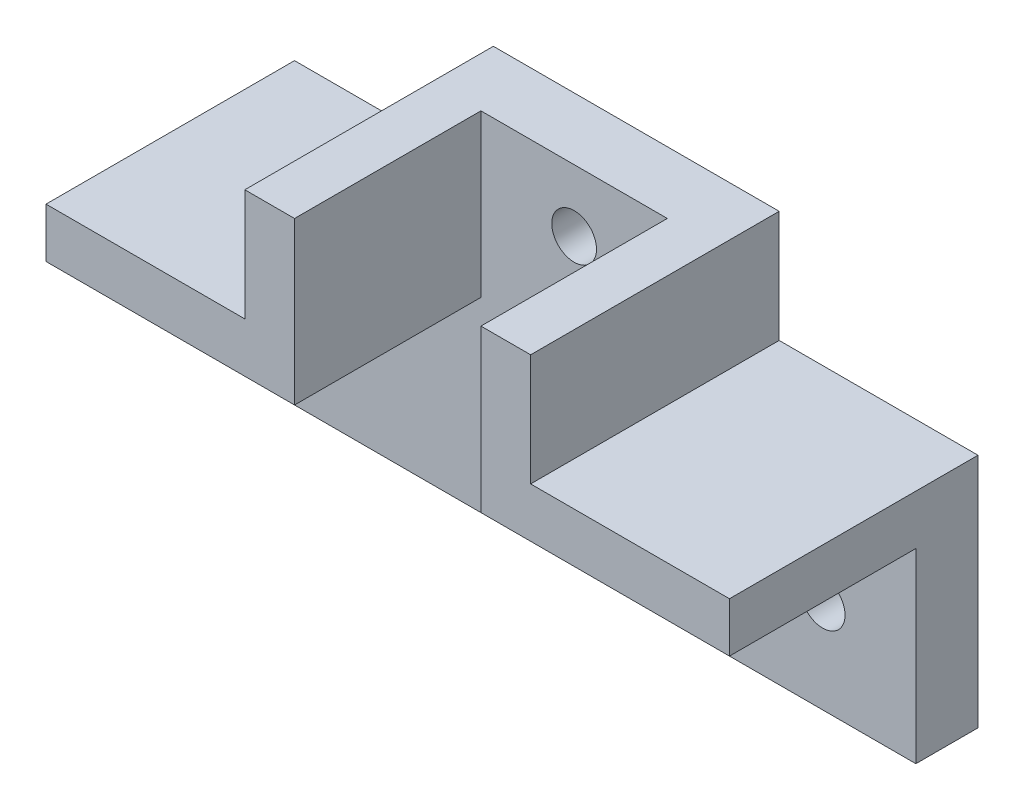
ISO-10303-21;
HEADER;
FILE_DESCRIPTION(('STEP AP214'),'2;1');
FILE_NAME('part.step','',(''),(''),'','','');
FILE_SCHEMA(('AUTOMOTIVE_DESIGN { 1 0 10303 214 1 1 1 1 }'));
ENDSEC;
DATA;
#1=APPLICATION_CONTEXT('core data for automotive mechanical design processes');
#2=APPLICATION_PROTOCOL_DEFINITION('international standard','automotive_design',2000,#1);
#3=PRODUCT_CONTEXT('',#1,'mechanical');
#4=PRODUCT('Part','Part','',(#3));
#5=PRODUCT_RELATED_PRODUCT_CATEGORY('part','',(#4));
#6=PRODUCT_DEFINITION_FORMATION('','',#4);
#7=PRODUCT_DEFINITION_CONTEXT('part definition',#1,'design');
#8=PRODUCT_DEFINITION('design','',#6,#7);
#9=PRODUCT_DEFINITION_SHAPE('','',#8);
#10=(LENGTH_UNIT() NAMED_UNIT(*) SI_UNIT(.MILLI.,.METRE.));
#11=(NAMED_UNIT(*) PLANE_ANGLE_UNIT() SI_UNIT($,.RADIAN.));
#12=(NAMED_UNIT(*) SI_UNIT($,.STERADIAN.) SOLID_ANGLE_UNIT());
#13=UNCERTAINTY_MEASURE_WITH_UNIT(LENGTH_MEASURE(1.E-05),#10,'distance_accuracy_value','');
#14=(GEOMETRIC_REPRESENTATION_CONTEXT(3) GLOBAL_UNCERTAINTY_ASSIGNED_CONTEXT((#13)) GLOBAL_UNIT_ASSIGNED_CONTEXT((#10,
#11,#12)) REPRESENTATION_CONTEXT('',''));
#15=CARTESIAN_POINT('',(0.,0.,0.));
#16=DIRECTION('',(0.,0.,1.));
#17=DIRECTION('',(1.,0.,0.));
#18=AXIS2_PLACEMENT_3D('',#15,#16,#17);
#19=CARTESIAN_POINT('',(-20.6862745098039,2.73529411764706,5.));
#20=DIRECTION('',(1.,0.,0.));
#21=DIRECTION('',(0.,1.,0.));
#22=AXIS2_PLACEMENT_3D('',#19,#20,#21);
#23=PLANE('',#22);
#24=DIRECTION('',(0.,-1.,0.));
#25=VECTOR('',#24,1.);
#26=CARTESIAN_POINT('',(-20.6862745098039,2.73529411764706,0.));
#27=LINE('',#26,#25);
#28=CARTESIAN_POINT('',(-20.6862745098039,6.73529411764706,0.));
#29=VERTEX_POINT('',#28);
#30=CARTESIAN_POINT('',(-20.6862745098039,-12.2647058823529,0.));
#31=VERTEX_POINT('',#30);
#32=EDGE_CURVE('E171',#29,#31,#27,.T.);
#33=ORIENTED_EDGE('',*,*,#32,.T.);
#34=DIRECTION('',(0.,0.,-1.));
#35=VECTOR('',#34,1.);
#36=CARTESIAN_POINT('',(-20.6862745098039,-12.2647058823529,5.));
#37=LINE('',#36,#35);
#38=CARTESIAN_POINT('',(-20.6862745098039,-12.2647058823529,5.));
#39=VERTEX_POINT('',#38);
#40=EDGE_CURVE('E11',#39,#31,#37,.T.);
#41=ORIENTED_EDGE('',*,*,#40,.F.);
#42=DIRECTION('',(0.,-1.,0.));
#43=VECTOR('',#42,1.);
#44=CARTESIAN_POINT('',(-20.6862745098039,2.73529411764706,5.));
#45=LINE('',#44,#43);
#46=CARTESIAN_POINT('',(-20.6862745098039,2.73529411764706,5.));
#47=VERTEX_POINT('',#46);
#48=EDGE_CURVE('E154',#47,#39,#45,.T.);
#49=ORIENTED_EDGE('',*,*,#48,.F.);
#50=DIRECTION('',(0.,0.,-1.));
#51=VECTOR('',#50,1.);
#52=CARTESIAN_POINT('',(-20.6862745098039,2.73529411764706,20.));
#53=LINE('',#52,#51);
#54=CARTESIAN_POINT('',(-20.6862745098039,2.73529411764706,20.));
#55=VERTEX_POINT('',#54);
#56=EDGE_CURVE('E76',#55,#47,#53,.T.);
#57=ORIENTED_EDGE('',*,*,#56,.F.);
#58=DIRECTION('',(0.,1.,0.));
#59=VECTOR('',#58,1.);
#60=CARTESIAN_POINT('',(-20.6862745098039,2.73529411764706,20.));
#61=LINE('',#60,#59);
#62=CARTESIAN_POINT('',(-20.6862745098039,6.73529411764706,20.));
#63=VERTEX_POINT('',#62);
#64=EDGE_CURVE('E243',#55,#63,#61,.T.);
#65=ORIENTED_EDGE('',*,*,#64,.T.);
#66=DIRECTION('',(0.,0.,-1.));
#67=VECTOR('',#66,1.);
#68=CARTESIAN_POINT('',(-20.6862745098039,6.73529411764706,20.));
#69=LINE('',#68,#67);
#70=EDGE_CURVE('E149',#63,#29,#69,.T.);
#71=ORIENTED_EDGE('',*,*,#70,.T.);
#72=EDGE_LOOP('',(#33,#41,#49,#57,#65,#71));
#73=FACE_BOUND('',#72,.T.);
#74=ADVANCED_FACE('F39',(#73),#23,.F.);
#75=CARTESIAN_POINT('',(-20.6862745098039,-12.2647058823529,5.));
#76=DIRECTION('',(0.,1.,0.));
#77=DIRECTION('',(0.,0.,1.));
#78=AXIS2_PLACEMENT_3D('',#75,#76,#77);
#79=PLANE('',#78);
#80=DIRECTION('',(1.,0.,0.));
#81=VECTOR('',#80,1.);
#82=CARTESIAN_POINT('',(-20.6862745098039,-12.2647058823529,0.));
#83=LINE('',#82,#81);
#84=CARTESIAN_POINT('',(34.3137254901961,-12.2647058823529,0.));
#85=VERTEX_POINT('',#84);
#86=EDGE_CURVE('E68',#31,#85,#83,.T.);
#87=ORIENTED_EDGE('',*,*,#86,.T.);
#88=DIRECTION('',(0.,0.,-1.));
#89=VECTOR('',#88,1.);
#90=CARTESIAN_POINT('',(34.3137254901961,-12.2647058823529,5.));
#91=LINE('',#90,#89);
#92=CARTESIAN_POINT('',(34.3137254901961,-12.2647058823529,5.));
#93=VERTEX_POINT('',#92);
#94=EDGE_CURVE('E48',#93,#85,#91,.T.);
#95=ORIENTED_EDGE('',*,*,#94,.F.);
#96=DIRECTION('',(1.,0.,0.));
#97=VECTOR('',#96,1.);
#98=CARTESIAN_POINT('',(-20.6862745098039,-12.2647058823529,5.));
#99=LINE('',#98,#97);
#100=EDGE_CURVE('E157',#39,#93,#99,.T.);
#101=ORIENTED_EDGE('',*,*,#100,.F.);
#102=ORIENTED_EDGE('',*,*,#40,.T.);
#103=EDGE_LOOP('',(#87,#95,#101,#102));
#104=FACE_BOUND('',#103,.T.);
#105=ADVANCED_FACE('F286',(#104),#79,.F.);
#106=CARTESIAN_POINT('',(34.3137254901961,2.73529411764706,5.));
#107=DIRECTION('',(-1.,0.,0.));
#108=DIRECTION('',(0.,0.,1.));
#109=AXIS2_PLACEMENT_3D('',#106,#107,#108);
#110=PLANE('',#109);
#111=DIRECTION('',(0.,1.,0.));
#112=VECTOR('',#111,1.);
#113=CARTESIAN_POINT('',(34.3137254901961,2.73529411764706,0.));
#114=LINE('',#113,#112);
#115=CARTESIAN_POINT('',(34.3137254901961,6.73529411764706,0.));
#116=VERTEX_POINT('',#115);
#117=EDGE_CURVE('E177',#85,#116,#114,.T.);
#118=ORIENTED_EDGE('',*,*,#117,.T.);
#119=DIRECTION('',(0.,0.,-1.));
#120=VECTOR('',#119,1.);
#121=CARTESIAN_POINT('',(34.3137254901961,6.73529411764706,20.));
#122=LINE('',#121,#120);
#123=CARTESIAN_POINT('',(34.3137254901961,6.73529411764706,20.));
#124=VERTEX_POINT('',#123);
#125=EDGE_CURVE('E211',#124,#116,#122,.T.);
#126=ORIENTED_EDGE('',*,*,#125,.F.);
#127=DIRECTION('',(0.,1.,0.));
#128=VECTOR('',#127,1.);
#129=CARTESIAN_POINT('',(34.3137254901961,2.73529411764705,20.));
#130=LINE('',#129,#128);
#131=CARTESIAN_POINT('',(34.3137254901961,2.73529411764705,20.));
#132=VERTEX_POINT('',#131);
#133=EDGE_CURVE('E208',#132,#124,#130,.T.);
#134=ORIENTED_EDGE('',*,*,#133,.F.);
#135=DIRECTION('',(0.,0.,-1.));
#136=VECTOR('',#135,1.);
#137=CARTESIAN_POINT('',(34.3137254901961,2.73529411764705,20.));
#138=LINE('',#137,#136);
#139=CARTESIAN_POINT('',(34.3137254901961,2.73529411764706,5.));
#140=VERTEX_POINT('',#139);
#141=EDGE_CURVE('E240',#132,#140,#138,.T.);
#142=ORIENTED_EDGE('',*,*,#141,.T.);
#143=DIRECTION('',(0.,1.,0.));
#144=VECTOR('',#143,1.);
#145=CARTESIAN_POINT('',(34.3137254901961,2.73529411764706,5.));
#146=LINE('',#145,#144);
#147=EDGE_CURVE('E161',#93,#140,#146,.T.);
#148=ORIENTED_EDGE('',*,*,#147,.F.);
#149=ORIENTED_EDGE('',*,*,#94,.T.);
#150=EDGE_LOOP('',(#118,#126,#134,#142,#148,#149));
#151=FACE_BOUND('',#150,.T.);
#152=ADVANCED_FACE('F187',(#151),#110,.F.);
#153=CARTESIAN_POINT('',(-0.686274509803913,15.7352941176471,5.));
#154=DIRECTION('',(0.,-1.,0.));
#155=DIRECTION('',(0.,0.,-1.));
#156=AXIS2_PLACEMENT_3D('',#153,#154,#155);
#157=PLANE('',#156);
#158=DIRECTION('',(-1.,0.,0.));
#159=VECTOR('',#158,1.);
#160=CARTESIAN_POINT('',(-0.686274509803913,15.7352941176471,0.));
#161=LINE('',#160,#159);
#162=CARTESIAN_POINT('',(18.3137254901961,15.7352941176471,0.));
#163=VERTEX_POINT('',#162);
#164=CARTESIAN_POINT('',(-4.68627450980391,15.7352941176471,0.));
#165=VERTEX_POINT('',#164);
#166=EDGE_CURVE('E158',#163,#165,#161,.T.);
#167=ORIENTED_EDGE('',*,*,#166,.T.);
#168=DIRECTION('',(0.,0.,-1.));
#169=VECTOR('',#168,1.);
#170=CARTESIAN_POINT('',(-4.68627450980391,15.7352941176471,20.));
#171=LINE('',#170,#169);
#172=CARTESIAN_POINT('',(-4.68627450980391,15.7352941176471,20.));
#173=VERTEX_POINT('',#172);
#174=EDGE_CURVE('E137',#173,#165,#171,.T.);
#175=ORIENTED_EDGE('',*,*,#174,.F.);
#176=DIRECTION('',(-1.,0.,0.));
#177=VECTOR('',#176,1.);
#178=CARTESIAN_POINT('',(-0.686274509803913,15.7352941176471,20.));
#179=LINE('',#178,#177);
#180=CARTESIAN_POINT('',(-0.686274509803913,15.7352941176471,20.));
#181=VERTEX_POINT('',#180);
#182=EDGE_CURVE('E134',#181,#173,#179,.T.);
#183=ORIENTED_EDGE('',*,*,#182,.F.);
#184=DIRECTION('',(0.,0.,-1.));
#185=VECTOR('',#184,1.);
#186=CARTESIAN_POINT('',(-0.686274509803913,15.7352941176471,20.));
#187=LINE('',#186,#185);
#188=CARTESIAN_POINT('',(-0.686274509803913,15.7352941176471,5.));
#189=VERTEX_POINT('',#188);
#190=EDGE_CURVE('E125',#181,#189,#187,.T.);
#191=ORIENTED_EDGE('',*,*,#190,.T.);
#192=DIRECTION('',(-1.,0.,0.));
#193=VECTOR('',#192,1.);
#194=CARTESIAN_POINT('',(-0.686274509803913,15.7352941176471,5.));
#195=LINE('',#194,#193);
#196=CARTESIAN_POINT('',(14.3137254901961,15.7352941176471,5.));
#197=VERTEX_POINT('',#196);
#198=EDGE_CURVE('E108',#197,#189,#195,.T.);
#199=ORIENTED_EDGE('',*,*,#198,.F.);
#200=DIRECTION('',(0.,0.,-1.));
#201=VECTOR('',#200,1.);
#202=CARTESIAN_POINT('',(14.3137254901961,15.7352941176471,20.));
#203=LINE('',#202,#201);
#204=CARTESIAN_POINT('',(14.3137254901961,15.7352941176471,20.));
#205=VERTEX_POINT('',#204);
#206=EDGE_CURVE('E233',#205,#197,#203,.T.);
#207=ORIENTED_EDGE('',*,*,#206,.F.);
#208=DIRECTION('',(1.,0.,0.));
#209=VECTOR('',#208,1.);
#210=CARTESIAN_POINT('',(14.3137254901961,15.7352941176471,20.));
#211=LINE('',#210,#209);
#212=CARTESIAN_POINT('',(18.3137254901961,15.7352941176471,20.));
#213=VERTEX_POINT('',#212);
#214=EDGE_CURVE('E308',#205,#213,#211,.T.);
#215=ORIENTED_EDGE('',*,*,#214,.T.);
#216=DIRECTION('',(0.,0.,-1.));
#217=VECTOR('',#216,1.);
#218=CARTESIAN_POINT('',(18.3137254901961,15.7352941176471,20.));
#219=LINE('',#218,#217);
#220=EDGE_CURVE('E226',#213,#163,#219,.T.);
#221=ORIENTED_EDGE('',*,*,#220,.T.);
#222=EDGE_LOOP('',(#167,#175,#183,#191,#199,#207,#215,#221));
#223=FACE_BOUND('',#222,.T.);
#224=ADVANCED_FACE('F131',(#223),#157,.F.);
#225=CARTESIAN_POINT('',(0.,0.,5.));
#226=DIRECTION('',(0.,0.,1.));
#227=DIRECTION('',(1.,0.,0.));
#228=AXIS2_PLACEMENT_3D('',#225,#226,#227);
#229=PLANE('',#228);
#230=CARTESIAN_POINT('',(6.81372549019609,10.7352941176471,5.));
#231=DIRECTION('',(0.,0.,1.));
#232=DIRECTION('',(1.,0.,0.));
#233=AXIS2_PLACEMENT_3D('',#230,#231,#232);
#234=CIRCLE('',#233,1.8);
#235=CARTESIAN_POINT('',(8.61372549019609,10.7352941176471,5.));
#236=VERTEX_POINT('',#235);
#237=EDGE_CURVE('E324',#236,#236,#234,.T.);
#238=ORIENTED_EDGE('',*,*,#237,.F.);
#239=EDGE_LOOP('',(#238));
#240=FACE_BOUND('',#239,.T.);
#241=CARTESIAN_POINT('',(-13.1862745098039,-4.76470588235294,5.));
#242=DIRECTION('',(0.,0.,1.));
#243=DIRECTION('',(1.,0.,0.));
#244=AXIS2_PLACEMENT_3D('',#241,#242,#243);
#245=CIRCLE('',#244,1.8);
#246=CARTESIAN_POINT('',(-11.3862745098039,-4.76470588235294,5.));
#247=VERTEX_POINT('',#246);
#248=EDGE_CURVE('E336',#247,#247,#245,.T.);
#249=ORIENTED_EDGE('',*,*,#248,.F.);
#250=EDGE_LOOP('',(#249));
#251=FACE_BOUND('',#250,.T.);
#252=CARTESIAN_POINT('',(26.8137254901961,-4.76470588235294,5.));
#253=DIRECTION('',(0.,0.,1.));
#254=DIRECTION('',(1.,0.,0.));
#255=AXIS2_PLACEMENT_3D('',#252,#253,#254);
#256=CIRCLE('',#255,1.8);
#257=CARTESIAN_POINT('',(28.6137254901961,-4.76470588235294,5.));
#258=VERTEX_POINT('',#257);
#259=EDGE_CURVE('E343',#258,#258,#256,.T.);
#260=ORIENTED_EDGE('',*,*,#259,.F.);
#261=EDGE_LOOP('',(#260));
#262=FACE_BOUND('',#261,.T.);
#263=ORIENTED_EDGE('',*,*,#48,.T.);
#264=ORIENTED_EDGE('',*,*,#100,.T.);
#265=ORIENTED_EDGE('',*,*,#147,.T.);
#266=DIRECTION('',(-1.,0.,0.));
#267=VECTOR('',#266,1.);
#268=CARTESIAN_POINT('',(14.3137254901961,2.73529411764706,5.));
#269=LINE('',#268,#267);
#270=CARTESIAN_POINT('',(14.3137254901961,2.73529411764706,5.));
#271=VERTEX_POINT('',#270);
#272=EDGE_CURVE('E164',#140,#271,#269,.T.);
#273=ORIENTED_EDGE('',*,*,#272,.T.);
#274=DIRECTION('',(0.,1.,0.));
#275=VECTOR('',#274,1.);
#276=CARTESIAN_POINT('',(14.3137254901961,15.7352941176471,5.));
#277=LINE('',#276,#275);
#278=EDGE_CURVE('E113',#271,#197,#277,.T.);
#279=ORIENTED_EDGE('',*,*,#278,.T.);
#280=ORIENTED_EDGE('',*,*,#198,.T.);
#281=DIRECTION('',(0.,-1.,0.));
#282=VECTOR('',#281,1.);
#283=CARTESIAN_POINT('',(-0.686274509803913,15.7352941176471,5.));
#284=LINE('',#283,#282);
#285=CARTESIAN_POINT('',(-0.686274509803911,2.73529411764706,5.));
#286=VERTEX_POINT('',#285);
#287=EDGE_CURVE('E111',#189,#286,#284,.T.);
#288=ORIENTED_EDGE('',*,*,#287,.T.);
#289=DIRECTION('',(-1.,0.,0.));
#290=VECTOR('',#289,1.);
#291=CARTESIAN_POINT('',(-20.6862745098039,2.73529411764706,5.));
#292=LINE('',#291,#290);
#293=EDGE_CURVE('E56',#286,#47,#292,.T.);
#294=ORIENTED_EDGE('',*,*,#293,.T.);
#295=EDGE_LOOP('',(#263,#264,#265,#273,#279,#280,#288,#294));
#296=FACE_BOUND('',#295,.T.);
#297=ADVANCED_FACE('F110',(#240,#251,#262,#296),#229,.T.);
#298=CARTESIAN_POINT('',(0.,0.,0.));
#299=DIRECTION('',(0.,0.,1.));
#300=DIRECTION('',(1.,0.,0.));
#301=AXIS2_PLACEMENT_3D('',#298,#299,#300);
#302=PLANE('',#301);
#303=CARTESIAN_POINT('',(6.81372549019609,10.7352941176471,0.));
#304=DIRECTION('',(0.,0.,1.));
#305=DIRECTION('',(1.,0.,0.));
#306=AXIS2_PLACEMENT_3D('',#303,#304,#305);
#307=CIRCLE('',#306,1.8);
#308=CARTESIAN_POINT('',(8.61372549019609,10.7352941176471,0.));
#309=VERTEX_POINT('',#308);
#310=EDGE_CURVE('E321',#309,#309,#307,.T.);
#311=ORIENTED_EDGE('',*,*,#310,.T.);
#312=EDGE_LOOP('',(#311));
#313=FACE_BOUND('',#312,.T.);
#314=CARTESIAN_POINT('',(-13.1862745098039,-4.76470588235294,0.));
#315=DIRECTION('',(0.,0.,1.));
#316=DIRECTION('',(1.,0.,0.));
#317=AXIS2_PLACEMENT_3D('',#314,#315,#316);
#318=CIRCLE('',#317,1.8);
#319=CARTESIAN_POINT('',(-11.3862745098039,-4.76470588235294,0.));
#320=VERTEX_POINT('',#319);
#321=EDGE_CURVE('E330',#320,#320,#318,.T.);
#322=ORIENTED_EDGE('',*,*,#321,.T.);
#323=EDGE_LOOP('',(#322));
#324=FACE_BOUND('',#323,.T.);
#325=CARTESIAN_POINT('',(26.8137254901961,-4.76470588235294,0.));
#326=DIRECTION('',(0.,0.,1.));
#327=DIRECTION('',(1.,0.,0.));
#328=AXIS2_PLACEMENT_3D('',#325,#326,#327);
#329=CIRCLE('',#328,1.8);
#330=CARTESIAN_POINT('',(28.6137254901961,-4.76470588235294,0.));
#331=VERTEX_POINT('',#330);
#332=EDGE_CURVE('E340',#331,#331,#329,.T.);
#333=ORIENTED_EDGE('',*,*,#332,.T.);
#334=EDGE_LOOP('',(#333));
#335=FACE_BOUND('',#334,.T.);
#336=ORIENTED_EDGE('',*,*,#166,.F.);
#337=DIRECTION('',(0.,-1.,0.));
#338=VECTOR('',#337,1.);
#339=CARTESIAN_POINT('',(18.3137254901961,15.7352941176471,0.));
#340=LINE('',#339,#338);
#341=CARTESIAN_POINT('',(18.3137254901961,6.73529411764706,0.));
#342=VERTEX_POINT('',#341);
#343=EDGE_CURVE('E201',#163,#342,#340,.T.);
#344=ORIENTED_EDGE('',*,*,#343,.T.);
#345=DIRECTION('',(-1.,0.,0.));
#346=VECTOR('',#345,1.);
#347=CARTESIAN_POINT('',(34.3137254901961,6.73529411764706,0.));
#348=LINE('',#347,#346);
#349=EDGE_CURVE('E197',#116,#342,#348,.T.);
#350=ORIENTED_EDGE('',*,*,#349,.F.);
#351=ORIENTED_EDGE('',*,*,#117,.F.);
#352=ORIENTED_EDGE('',*,*,#86,.F.);
#353=ORIENTED_EDGE('',*,*,#32,.F.);
#354=DIRECTION('',(1.,0.,0.));
#355=VECTOR('',#354,1.);
#356=CARTESIAN_POINT('',(-6.07997052750672,6.73529411764706,0.));
#357=LINE('',#356,#355);
#358=CARTESIAN_POINT('',(-4.68627450980391,6.73529411764706,0.));
#359=VERTEX_POINT('',#358);
#360=EDGE_CURVE('E218',#29,#359,#357,.T.);
#361=ORIENTED_EDGE('',*,*,#360,.T.);
#362=DIRECTION('',(0.,-1.,0.));
#363=VECTOR('',#362,1.);
#364=CARTESIAN_POINT('',(-4.68627450980391,15.7352941176471,0.));
#365=LINE('',#364,#363);
#366=EDGE_CURVE('E224',#165,#359,#365,.T.);
#367=ORIENTED_EDGE('',*,*,#366,.F.);
#368=EDGE_LOOP('',(#336,#344,#350,#351,#352,#353,#361,#367));
#369=FACE_BOUND('',#368,.T.);
#370=ADVANCED_FACE('F194',(#313,#324,#335,#369),#302,.F.);
#371=CARTESIAN_POINT('',(-20.6862745098039,2.73529411764706,20.));
#372=DIRECTION('',(0.,1.,0.));
#373=DIRECTION('',(-1.,0.,0.));
#374=AXIS2_PLACEMENT_3D('',#371,#372,#373);
#375=PLANE('',#374);
#376=ORIENTED_EDGE('',*,*,#293,.F.);
#377=DIRECTION('',(0.,0.,-1.));
#378=VECTOR('',#377,1.);
#379=CARTESIAN_POINT('',(-0.686274509803915,2.73529411764706,20.));
#380=LINE('',#379,#378);
#381=CARTESIAN_POINT('',(-0.686274509803915,2.73529411764706,20.));
#382=VERTEX_POINT('',#381);
#383=EDGE_CURVE('E128',#382,#286,#380,.T.);
#384=ORIENTED_EDGE('',*,*,#383,.F.);
#385=DIRECTION('',(1.,0.,0.));
#386=VECTOR('',#385,1.);
#387=CARTESIAN_POINT('',(-20.6862745098039,2.73529411764706,20.));
#388=LINE('',#387,#386);
#389=EDGE_CURVE('E153',#55,#382,#388,.T.);
#390=ORIENTED_EDGE('',*,*,#389,.F.);
#391=ORIENTED_EDGE('',*,*,#56,.T.);
#392=EDGE_LOOP('',(#376,#384,#390,#391));
#393=FACE_BOUND('',#392,.T.);
#394=ADVANCED_FACE('F265',(#393),#375,.F.);
#395=CARTESIAN_POINT('',(-0.686274509803913,15.7352941176471,20.));
#396=DIRECTION('',(1.,0.,0.));
#397=DIRECTION('',(0.,1.,0.));
#398=AXIS2_PLACEMENT_3D('',#395,#396,#397);
#399=PLANE('',#398);
#400=ORIENTED_EDGE('',*,*,#383,.T.);
#401=ORIENTED_EDGE('',*,*,#287,.F.);
#402=ORIENTED_EDGE('',*,*,#190,.F.);
#403=DIRECTION('',(0.,-1.,0.));
#404=VECTOR('',#403,1.);
#405=CARTESIAN_POINT('',(-0.686274509803913,15.7352941176471,20.));
#406=LINE('',#405,#404);
#407=EDGE_CURVE('E256',#181,#382,#406,.T.);
#408=ORIENTED_EDGE('',*,*,#407,.T.);
#409=EDGE_LOOP('',(#400,#401,#402,#408));
#410=FACE_BOUND('',#409,.T.);
#411=ADVANCED_FACE('F123',(#410),#399,.T.);
#412=CARTESIAN_POINT('',(-4.68627450980391,15.7352941176471,20.));
#413=DIRECTION('',(1.,0.,0.));
#414=DIRECTION('',(0.,1.,0.));
#415=AXIS2_PLACEMENT_3D('',#412,#413,#414);
#416=PLANE('',#415);
#417=ORIENTED_EDGE('',*,*,#366,.T.);
#418=DIRECTION('',(0.,0.,-1.));
#419=VECTOR('',#418,1.);
#420=CARTESIAN_POINT('',(-4.68627450980391,6.73529411764706,20.));
#421=LINE('',#420,#419);
#422=CARTESIAN_POINT('',(-4.68627450980391,6.73529411764706,20.));
#423=VERTEX_POINT('',#422);
#424=EDGE_CURVE('E143',#423,#359,#421,.T.);
#425=ORIENTED_EDGE('',*,*,#424,.F.);
#426=DIRECTION('',(0.,-1.,0.));
#427=VECTOR('',#426,1.);
#428=CARTESIAN_POINT('',(-4.68627450980391,15.7352941176471,20.));
#429=LINE('',#428,#427);
#430=EDGE_CURVE('E250',#173,#423,#429,.T.);
#431=ORIENTED_EDGE('',*,*,#430,.F.);
#432=ORIENTED_EDGE('',*,*,#174,.T.);
#433=EDGE_LOOP('',(#417,#425,#431,#432));
#434=FACE_BOUND('',#433,.T.);
#435=ADVANCED_FACE('F283',(#434),#416,.F.);
#436=CARTESIAN_POINT('',(-6.07997052750672,6.73529411764706,20.));
#437=DIRECTION('',(0.,1.,0.));
#438=DIRECTION('',(0.,0.,1.));
#439=AXIS2_PLACEMENT_3D('',#436,#437,#438);
#440=PLANE('',#439);
#441=ORIENTED_EDGE('',*,*,#360,.F.);
#442=ORIENTED_EDGE('',*,*,#70,.F.);
#443=DIRECTION('',(1.,0.,0.));
#444=VECTOR('',#443,1.);
#445=CARTESIAN_POINT('',(-20.6862745098039,6.73529411764706,20.));
#446=LINE('',#445,#444);
#447=EDGE_CURVE('E246',#63,#423,#446,.T.);
#448=ORIENTED_EDGE('',*,*,#447,.T.);
#449=ORIENTED_EDGE('',*,*,#424,.T.);
#450=EDGE_LOOP('',(#441,#442,#448,#449));
#451=FACE_BOUND('',#450,.T.);
#452=ADVANCED_FACE('F284',(#451),#440,.T.);
#453=CARTESIAN_POINT('',(0.,0.,20.));
#454=DIRECTION('',(0.,0.,-1.));
#455=DIRECTION('',(-1.,0.,0.));
#456=AXIS2_PLACEMENT_3D('',#453,#454,#455);
#457=PLANE('',#456);
#458=ORIENTED_EDGE('',*,*,#64,.F.);
#459=ORIENTED_EDGE('',*,*,#389,.T.);
#460=ORIENTED_EDGE('',*,*,#407,.F.);
#461=ORIENTED_EDGE('',*,*,#182,.T.);
#462=ORIENTED_EDGE('',*,*,#430,.T.);
#463=ORIENTED_EDGE('',*,*,#447,.F.);
#464=EDGE_LOOP('',(#458,#459,#460,#461,#462,#463));
#465=FACE_BOUND('',#464,.T.);
#466=ADVANCED_FACE('F269',(#465),#457,.F.);
#467=CARTESIAN_POINT('',(34.3137254901961,6.73529411764706,20.));
#468=DIRECTION('',(0.,-1.,0.));
#469=DIRECTION('',(1.,0.,0.));
#470=AXIS2_PLACEMENT_3D('',#467,#468,#469);
#471=PLANE('',#470);
#472=ORIENTED_EDGE('',*,*,#349,.T.);
#473=DIRECTION('',(0.,0.,-1.));
#474=VECTOR('',#473,1.);
#475=CARTESIAN_POINT('',(18.3137254901961,6.73529411764706,20.));
#476=LINE('',#475,#474);
#477=CARTESIAN_POINT('',(18.3137254901961,6.73529411764706,20.));
#478=VERTEX_POINT('',#477);
#479=EDGE_CURVE('E219',#478,#342,#476,.T.);
#480=ORIENTED_EDGE('',*,*,#479,.F.);
#481=DIRECTION('',(-1.,0.,0.));
#482=VECTOR('',#481,1.);
#483=CARTESIAN_POINT('',(19.7074215078989,6.73529411764706,20.));
#484=LINE('',#483,#482);
#485=EDGE_CURVE('E214',#124,#478,#484,.T.);
#486=ORIENTED_EDGE('',*,*,#485,.F.);
#487=ORIENTED_EDGE('',*,*,#125,.T.);
#488=EDGE_LOOP('',(#472,#480,#486,#487));
#489=FACE_BOUND('',#488,.T.);
#490=ADVANCED_FACE('F212',(#489),#471,.F.);
#491=CARTESIAN_POINT('',(18.3137254901961,15.7352941176471,20.));
#492=DIRECTION('',(1.,0.,0.));
#493=DIRECTION('',(0.,1.,0.));
#494=AXIS2_PLACEMENT_3D('',#491,#492,#493);
#495=PLANE('',#494);
#496=ORIENTED_EDGE('',*,*,#343,.F.);
#497=ORIENTED_EDGE('',*,*,#220,.F.);
#498=DIRECTION('',(0.,-1.,0.));
#499=VECTOR('',#498,1.);
#500=CARTESIAN_POINT('',(18.3137254901961,15.7352941176471,20.));
#501=LINE('',#500,#499);
#502=EDGE_CURVE('E315',#213,#478,#501,.T.);
#503=ORIENTED_EDGE('',*,*,#502,.T.);
#504=ORIENTED_EDGE('',*,*,#479,.T.);
#505=EDGE_LOOP('',(#496,#497,#503,#504));
#506=FACE_BOUND('',#505,.T.);
#507=ADVANCED_FACE('F388',(#506),#495,.T.);
#508=CARTESIAN_POINT('',(14.3137254901961,15.7352941176471,20.));
#509=DIRECTION('',(1.,0.,0.));
#510=DIRECTION('',(0.,1.,0.));
#511=AXIS2_PLACEMENT_3D('',#508,#509,#510);
#512=PLANE('',#511);
#513=ORIENTED_EDGE('',*,*,#278,.F.);
#514=DIRECTION('',(0.,0.,-1.));
#515=VECTOR('',#514,1.);
#516=CARTESIAN_POINT('',(14.3137254901961,2.73529411764706,20.));
#517=LINE('',#516,#515);
#518=CARTESIAN_POINT('',(14.3137254901961,2.73529411764706,20.));
#519=VERTEX_POINT('',#518);
#520=EDGE_CURVE('E236',#519,#271,#517,.T.);
#521=ORIENTED_EDGE('',*,*,#520,.F.);
#522=DIRECTION('',(0.,-1.,0.));
#523=VECTOR('',#522,1.);
#524=CARTESIAN_POINT('',(14.3137254901961,15.7352941176471,20.));
#525=LINE('',#524,#523);
#526=EDGE_CURVE('E304',#205,#519,#525,.T.);
#527=ORIENTED_EDGE('',*,*,#526,.F.);
#528=ORIENTED_EDGE('',*,*,#206,.T.);
#529=EDGE_LOOP('',(#513,#521,#527,#528));
#530=FACE_BOUND('',#529,.T.);
#531=ADVANCED_FACE('F399',(#530),#512,.F.);
#532=CARTESIAN_POINT('',(34.3137254901961,2.73529411764705,20.));
#533=DIRECTION('',(0.,-1.,0.));
#534=DIRECTION('',(1.,0.,0.));
#535=AXIS2_PLACEMENT_3D('',#532,#533,#534);
#536=PLANE('',#535);
#537=ORIENTED_EDGE('',*,*,#520,.T.);
#538=ORIENTED_EDGE('',*,*,#272,.F.);
#539=ORIENTED_EDGE('',*,*,#141,.F.);
#540=DIRECTION('',(-1.,0.,0.));
#541=VECTOR('',#540,1.);
#542=CARTESIAN_POINT('',(34.3137254901961,2.73529411764705,20.));
#543=LINE('',#542,#541);
#544=EDGE_CURVE('E298',#132,#519,#543,.T.);
#545=ORIENTED_EDGE('',*,*,#544,.T.);
#546=EDGE_LOOP('',(#537,#538,#539,#545));
#547=FACE_BOUND('',#546,.T.);
#548=ADVANCED_FACE('F290',(#547),#536,.T.);
#549=CARTESIAN_POINT('',(13.6274509803922,0.,20.));
#550=DIRECTION('',(0.,0.,-1.));
#551=DIRECTION('',(1.,0.,0.));
#552=AXIS2_PLACEMENT_3D('',#549,#550,#551);
#553=PLANE('',#552);
#554=ORIENTED_EDGE('',*,*,#133,.T.);
#555=ORIENTED_EDGE('',*,*,#485,.T.);
#556=ORIENTED_EDGE('',*,*,#502,.F.);
#557=ORIENTED_EDGE('',*,*,#214,.F.);
#558=ORIENTED_EDGE('',*,*,#526,.T.);
#559=ORIENTED_EDGE('',*,*,#544,.F.);
#560=EDGE_LOOP('',(#554,#555,#556,#557,#558,#559));
#561=FACE_BOUND('',#560,.T.);
#562=ADVANCED_FACE('F301',(#561),#553,.F.);
#563=CARTESIAN_POINT('',(26.8137254901961,-4.76470588235294,0.));
#564=DIRECTION('',(0.,0.,1.));
#565=DIRECTION('',(1.,0.,0.));
#566=AXIS2_PLACEMENT_3D('',#563,#564,#565);
#567=CYLINDRICAL_SURFACE('',#566,1.8);
#568=ORIENTED_EDGE('',*,*,#332,.F.);
#569=EDGE_LOOP('',(#568));
#570=FACE_BOUND('',#569,.T.);
#571=ORIENTED_EDGE('',*,*,#259,.T.);
#572=EDGE_LOOP('',(#571));
#573=FACE_BOUND('',#572,.T.);
#574=ADVANCED_FACE('F348',(#570,#573),#567,.F.);
#575=CARTESIAN_POINT('',(-13.1862745098039,-4.76470588235294,0.));
#576=DIRECTION('',(0.,0.,1.));
#577=DIRECTION('',(1.,0.,0.));
#578=AXIS2_PLACEMENT_3D('',#575,#576,#577);
#579=CYLINDRICAL_SURFACE('',#578,1.8);
#580=ORIENTED_EDGE('',*,*,#321,.F.);
#581=EDGE_LOOP('',(#580));
#582=FACE_BOUND('',#581,.T.);
#583=ORIENTED_EDGE('',*,*,#248,.T.);
#584=EDGE_LOOP('',(#583));
#585=FACE_BOUND('',#584,.T.);
#586=ADVANCED_FACE('F447',(#582,#585),#579,.F.);
#587=CARTESIAN_POINT('',(6.81372549019609,10.7352941176471,0.));
#588=DIRECTION('',(0.,0.,1.));
#589=DIRECTION('',(1.,0.,0.));
#590=AXIS2_PLACEMENT_3D('',#587,#588,#589);
#591=CYLINDRICAL_SURFACE('',#590,1.8);
#592=ORIENTED_EDGE('',*,*,#310,.F.);
#593=EDGE_LOOP('',(#592));
#594=FACE_BOUND('',#593,.T.);
#595=ORIENTED_EDGE('',*,*,#237,.T.);
#596=EDGE_LOOP('',(#595));
#597=FACE_BOUND('',#596,.T.);
#598=ADVANCED_FACE('F457',(#594,#597),#591,.F.);
#599=CLOSED_SHELL('',(#74,#105,#152,#224,#297,#370,#394,#411,#435,#452,#466,#490,#507,#531,#548,
#562,#574,#586,#598));
#600=MANIFOLD_SOLID_BREP('B2',#599);
#601=ADVANCED_BREP_SHAPE_REPRESENTATION('',(#18,#600),#14);
#602=SHAPE_DEFINITION_REPRESENTATION(#9,#601);
ENDSEC;
END-ISO-10303-21;
